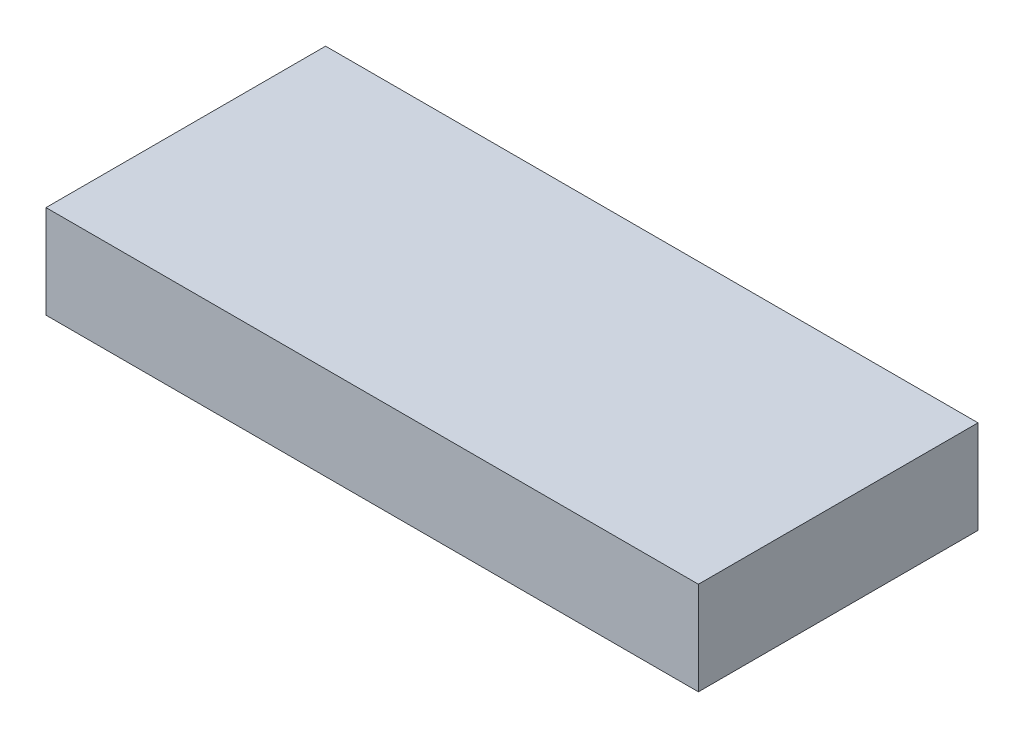
ISO-10303-21;
HEADER;
FILE_DESCRIPTION(('STEP AP214'),'2;1');
FILE_NAME('part.step','',(''),(''),'','','');
FILE_SCHEMA(('AUTOMOTIVE_DESIGN { 1 0 10303 214 1 1 1 1 }'));
ENDSEC;
DATA;
#1=APPLICATION_CONTEXT('core data for automotive mechanical design processes');
#2=APPLICATION_PROTOCOL_DEFINITION('international standard','automotive_design',2000,#1);
#3=PRODUCT_CONTEXT('',#1,'mechanical');
#4=PRODUCT('Part','Part','',(#3));
#5=PRODUCT_RELATED_PRODUCT_CATEGORY('part','',(#4));
#6=PRODUCT_DEFINITION_FORMATION('','',#4);
#7=PRODUCT_DEFINITION_CONTEXT('part definition',#1,'design');
#8=PRODUCT_DEFINITION('design','',#6,#7);
#9=PRODUCT_DEFINITION_SHAPE('','',#8);
#10=(LENGTH_UNIT() NAMED_UNIT(*) SI_UNIT(.MILLI.,.METRE.));
#11=(NAMED_UNIT(*) PLANE_ANGLE_UNIT() SI_UNIT($,.RADIAN.));
#12=(NAMED_UNIT(*) SI_UNIT($,.STERADIAN.) SOLID_ANGLE_UNIT());
#13=UNCERTAINTY_MEASURE_WITH_UNIT(LENGTH_MEASURE(1.E-05),#10,'distance_accuracy_value','');
#14=(GEOMETRIC_REPRESENTATION_CONTEXT(3) GLOBAL_UNCERTAINTY_ASSIGNED_CONTEXT((#13)) GLOBAL_UNIT_ASSIGNED_CONTEXT((#10,
#11,#12)) REPRESENTATION_CONTEXT('',''));
#15=CARTESIAN_POINT('',(0.,0.,0.));
#16=DIRECTION('',(0.,0.,1.));
#17=DIRECTION('',(1.,0.,0.));
#18=AXIS2_PLACEMENT_3D('',#15,#16,#17);
#19=CARTESIAN_POINT('',(0.,1.,-0.7));
#20=DIRECTION('',(0.,0.,-1.));
#21=DIRECTION('',(-1.,0.,0.));
#22=AXIS2_PLACEMENT_3D('',#19,#20,#21);
#23=PLANE('',#22);
#24=DIRECTION('',(1.,0.,0.));
#25=VECTOR('',#24,1.);
#26=CARTESIAN_POINT('',(0.,0.,-0.7));
#27=LINE('',#26,#25);
#28=CARTESIAN_POINT('',(-3.5,0.,-0.7));
#29=VERTEX_POINT('',#28);
#30=CARTESIAN_POINT('',(3.5,0.,-0.7));
#31=VERTEX_POINT('',#30);
#32=EDGE_CURVE('E11',#29,#31,#27,.T.);
#33=ORIENTED_EDGE('',*,*,#32,.T.);
#34=DIRECTION('',(0.,-1.,0.));
#35=VECTOR('',#34,1.);
#36=CARTESIAN_POINT('',(3.5,1.,-0.7));
#37=LINE('',#36,#35);
#38=CARTESIAN_POINT('',(3.5,1.,-0.7));
#39=VERTEX_POINT('',#38);
#40=EDGE_CURVE('E24',#39,#31,#37,.T.);
#41=ORIENTED_EDGE('',*,*,#40,.F.);
#42=DIRECTION('',(1.,0.,0.));
#43=VECTOR('',#42,1.);
#44=CARTESIAN_POINT('',(0.,1.,-0.7));
#45=LINE('',#44,#43);
#46=CARTESIAN_POINT('',(-3.5,1.,-0.7));
#47=VERTEX_POINT('',#46);
#48=EDGE_CURVE('E88',#47,#39,#45,.T.);
#49=ORIENTED_EDGE('',*,*,#48,.F.);
#50=DIRECTION('',(0.,-1.,0.));
#51=VECTOR('',#50,1.);
#52=CARTESIAN_POINT('',(-3.5,1.,-0.7));
#53=LINE('',#52,#51);
#54=EDGE_CURVE('E77',#47,#29,#53,.T.);
#55=ORIENTED_EDGE('',*,*,#54,.T.);
#56=EDGE_LOOP('',(#33,#41,#49,#55));
#57=FACE_BOUND('',#56,.T.);
#58=ADVANCED_FACE('F17',(#57),#23,.F.);
#59=CARTESIAN_POINT('',(3.5,1.,0.));
#60=DIRECTION('',(-1.,0.,0.));
#61=DIRECTION('',(0.,0.,1.));
#62=AXIS2_PLACEMENT_3D('',#59,#60,#61);
#63=PLANE('',#62);
#64=DIRECTION('',(0.,0.,-1.));
#65=VECTOR('',#64,1.);
#66=CARTESIAN_POINT('',(3.5,0.,0.));
#67=LINE('',#66,#65);
#68=CARTESIAN_POINT('',(3.5,0.,-3.7));
#69=VERTEX_POINT('',#68);
#70=EDGE_CURVE('E85',#31,#69,#67,.T.);
#71=ORIENTED_EDGE('',*,*,#70,.T.);
#72=DIRECTION('',(0.,-1.,0.));
#73=VECTOR('',#72,1.);
#74=CARTESIAN_POINT('',(3.5,1.,-3.7));
#75=LINE('',#74,#73);
#76=CARTESIAN_POINT('',(3.5,1.,-3.7));
#77=VERTEX_POINT('',#76);
#78=EDGE_CURVE('E83',#77,#69,#75,.T.);
#79=ORIENTED_EDGE('',*,*,#78,.F.);
#80=DIRECTION('',(0.,0.,-1.));
#81=VECTOR('',#80,1.);
#82=CARTESIAN_POINT('',(3.5,1.,0.));
#83=LINE('',#82,#81);
#84=EDGE_CURVE('E72',#39,#77,#83,.T.);
#85=ORIENTED_EDGE('',*,*,#84,.F.);
#86=ORIENTED_EDGE('',*,*,#40,.T.);
#87=EDGE_LOOP('',(#71,#79,#85,#86));
#88=FACE_BOUND('',#87,.T.);
#89=ADVANCED_FACE('F90',(#88),#63,.F.);
#90=CARTESIAN_POINT('',(0.,1.,-3.7));
#91=DIRECTION('',(0.,0.,-1.));
#92=DIRECTION('',(-1.,0.,0.));
#93=AXIS2_PLACEMENT_3D('',#90,#91,#92);
#94=PLANE('',#93);
#95=DIRECTION('',(1.,0.,0.));
#96=VECTOR('',#95,1.);
#97=CARTESIAN_POINT('',(0.,0.,-3.7));
#98=LINE('',#97,#96);
#99=CARTESIAN_POINT('',(-3.5,0.,-3.7));
#100=VERTEX_POINT('',#99);
#101=EDGE_CURVE('E60',#100,#69,#98,.T.);
#102=ORIENTED_EDGE('',*,*,#101,.F.);
#103=DIRECTION('',(0.,-1.,0.));
#104=VECTOR('',#103,1.);
#105=CARTESIAN_POINT('',(-3.5,1.,-3.7));
#106=LINE('',#105,#104);
#107=CARTESIAN_POINT('',(-3.5,1.,-3.7));
#108=VERTEX_POINT('',#107);
#109=EDGE_CURVE('E54',#108,#100,#106,.T.);
#110=ORIENTED_EDGE('',*,*,#109,.F.);
#111=DIRECTION('',(1.,0.,0.));
#112=VECTOR('',#111,1.);
#113=CARTESIAN_POINT('',(0.,1.,-3.7));
#114=LINE('',#113,#112);
#115=EDGE_CURVE('E58',#108,#77,#114,.T.);
#116=ORIENTED_EDGE('',*,*,#115,.T.);
#117=ORIENTED_EDGE('',*,*,#78,.T.);
#118=EDGE_LOOP('',(#102,#110,#116,#117));
#119=FACE_BOUND('',#118,.T.);
#120=ADVANCED_FACE('F56',(#119),#94,.T.);
#121=CARTESIAN_POINT('',(-3.5,1.,0.));
#122=DIRECTION('',(-1.,0.,0.));
#123=DIRECTION('',(0.,0.,1.));
#124=AXIS2_PLACEMENT_3D('',#121,#122,#123);
#125=PLANE('',#124);
#126=DIRECTION('',(0.,0.,-1.));
#127=VECTOR('',#126,1.);
#128=CARTESIAN_POINT('',(-3.5,0.,0.));
#129=LINE('',#128,#127);
#130=EDGE_CURVE('E73',#29,#100,#129,.T.);
#131=ORIENTED_EDGE('',*,*,#130,.F.);
#132=ORIENTED_EDGE('',*,*,#54,.F.);
#133=DIRECTION('',(0.,0.,-1.));
#134=VECTOR('',#133,1.);
#135=CARTESIAN_POINT('',(-3.5,1.,0.));
#136=LINE('',#135,#134);
#137=EDGE_CURVE('E70',#47,#108,#136,.T.);
#138=ORIENTED_EDGE('',*,*,#137,.T.);
#139=ORIENTED_EDGE('',*,*,#109,.T.);
#140=EDGE_LOOP('',(#131,#132,#138,#139));
#141=FACE_BOUND('',#140,.T.);
#142=ADVANCED_FACE('F76',(#141),#125,.T.);
#143=CARTESIAN_POINT('',(0.,1.,0.));
#144=DIRECTION('',(0.,1.,0.));
#145=DIRECTION('',(0.,0.,1.));
#146=AXIS2_PLACEMENT_3D('',#143,#144,#145);
#147=PLANE('',#146);
#148=ORIENTED_EDGE('',*,*,#48,.T.);
#149=ORIENTED_EDGE('',*,*,#84,.T.);
#150=ORIENTED_EDGE('',*,*,#115,.F.);
#151=ORIENTED_EDGE('',*,*,#137,.F.);
#152=EDGE_LOOP('',(#148,#149,#150,#151));
#153=FACE_BOUND('',#152,.T.);
#154=ADVANCED_FACE('F69',(#153),#147,.T.);
#155=CARTESIAN_POINT('',(0.,0.,0.));
#156=DIRECTION('',(0.,1.,0.));
#157=DIRECTION('',(0.,0.,1.));
#158=AXIS2_PLACEMENT_3D('',#155,#156,#157);
#159=PLANE('',#158);
#160=ORIENTED_EDGE('',*,*,#32,.F.);
#161=ORIENTED_EDGE('',*,*,#130,.T.);
#162=ORIENTED_EDGE('',*,*,#101,.T.);
#163=ORIENTED_EDGE('',*,*,#70,.F.);
#164=EDGE_LOOP('',(#160,#161,#162,#163));
#165=FACE_BOUND('',#164,.T.);
#166=ADVANCED_FACE('F91',(#165),#159,.F.);
#167=CLOSED_SHELL('',(#58,#89,#120,#142,#154,#166));
#168=MANIFOLD_SOLID_BREP('B1',#167);
#169=ADVANCED_BREP_SHAPE_REPRESENTATION('',(#18,#168),#14);
#170=SHAPE_DEFINITION_REPRESENTATION(#9,#169);
ENDSEC;
END-ISO-10303-21;
